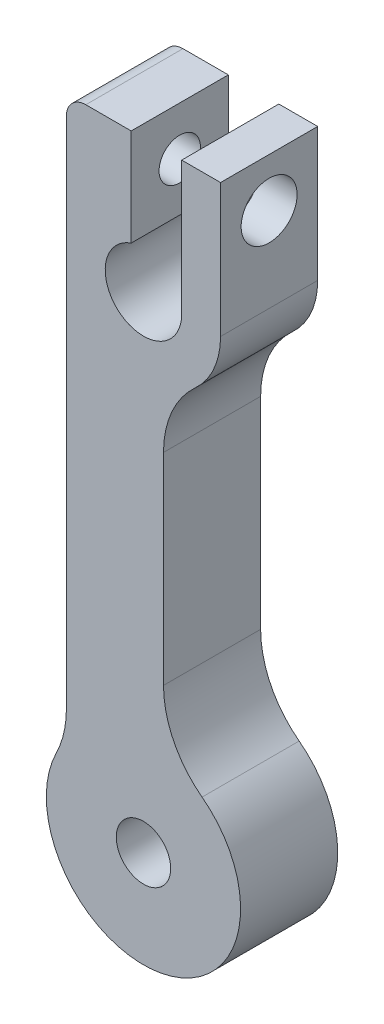
ISO-10303-21;
HEADER;
FILE_DESCRIPTION(('STEP AP214'),'2;1');
FILE_NAME('part.step','',(''),(''),'','','');
FILE_SCHEMA(('AUTOMOTIVE_DESIGN { 1 0 10303 214 1 1 1 1 }'));
ENDSEC;
DATA;
#1=APPLICATION_CONTEXT('core data for automotive mechanical design processes');
#2=APPLICATION_PROTOCOL_DEFINITION('international standard','automotive_design',2000,#1);
#3=PRODUCT_CONTEXT('',#1,'mechanical');
#4=PRODUCT('Part','Part','',(#3));
#5=PRODUCT_RELATED_PRODUCT_CATEGORY('part','',(#4));
#6=PRODUCT_DEFINITION_FORMATION('','',#4);
#7=PRODUCT_DEFINITION_CONTEXT('part definition',#1,'design');
#8=PRODUCT_DEFINITION('design','',#6,#7);
#9=PRODUCT_DEFINITION_SHAPE('','',#8);
#10=(LENGTH_UNIT() NAMED_UNIT(*) SI_UNIT(.MILLI.,.METRE.));
#11=(NAMED_UNIT(*) PLANE_ANGLE_UNIT() SI_UNIT($,.RADIAN.));
#12=(NAMED_UNIT(*) SI_UNIT($,.STERADIAN.) SOLID_ANGLE_UNIT());
#13=UNCERTAINTY_MEASURE_WITH_UNIT(LENGTH_MEASURE(1.E-05),#10,'distance_accuracy_value','');
#14=(GEOMETRIC_REPRESENTATION_CONTEXT(3) GLOBAL_UNCERTAINTY_ASSIGNED_CONTEXT((#13)) GLOBAL_UNIT_ASSIGNED_CONTEXT((#10,
#11,#12)) REPRESENTATION_CONTEXT('',''));
#15=CARTESIAN_POINT('',(0.,0.,0.));
#16=DIRECTION('',(0.,0.,1.));
#17=DIRECTION('',(1.,0.,0.));
#18=AXIS2_PLACEMENT_3D('',#15,#16,#17);
#19=CARTESIAN_POINT('',(7.66,10.1298766033945,6.35));
#20=DIRECTION('',(0.,0.,1.));
#21=DIRECTION('',(1.,0.,0.));
#22=AXIS2_PLACEMENT_3D('',#19,#20,#21);
#23=PLANE('',#22);
#24=DIRECTION('',(-1.,0.,0.));
#25=VECTOR('',#24,1.);
#26=CARTESIAN_POINT('',(-0.802,40.4678673949358,6.35));
#27=LINE('',#26,#25);
#28=CARTESIAN_POINT('',(-0.802,40.4678673949358,6.35));
#29=VERTEX_POINT('',#28);
#30=CARTESIAN_POINT('',(-3.77,40.4678673949358,6.35));
#31=VERTEX_POINT('',#30);
#32=EDGE_CURVE('E241',#29,#31,#27,.T.);
#33=ORIENTED_EDGE('',*,*,#32,.T.);
#34=CARTESIAN_POINT('',(-3.77,39.1978673949358,6.35));
#35=DIRECTION('',(0.,0.,1.));
#36=DIRECTION('',(1.,0.,0.));
#37=AXIS2_PLACEMENT_3D('',#34,#35,#36);
#38=CIRCLE('',#37,1.27);
#39=CARTESIAN_POINT('',(-5.04,39.1978673949358,6.35));
#40=VERTEX_POINT('',#39);
#41=EDGE_CURVE('E13',#31,#40,#38,.T.);
#42=ORIENTED_EDGE('',*,*,#41,.T.);
#43=DIRECTION('',(0.,-1.,0.));
#44=VECTOR('',#43,1.);
#45=CARTESIAN_POINT('',(-5.04,40.4678673949358,6.35));
#46=LINE('',#45,#44);
#47=CARTESIAN_POINT('',(-5.04,5.61764185401669,6.35));
#48=VERTEX_POINT('',#47);
#49=EDGE_CURVE('E239',#40,#48,#46,.T.);
#50=ORIENTED_EDGE('',*,*,#49,.T.);
#51=CARTESIAN_POINT('',(-11.39,5.61764185401669,6.35));
#52=DIRECTION('',(0.,0.,-1.));
#53=DIRECTION('',(-1.,0.,0.));
#54=AXIS2_PLACEMENT_3D('',#51,#52,#53);
#55=CIRCLE('',#54,6.35);
#56=CARTESIAN_POINT('',(-5.695,2.80882092700834,6.35));
#57=VERTEX_POINT('',#56);
#58=EDGE_CURVE('E237',#48,#57,#55,.T.);
#59=ORIENTED_EDGE('',*,*,#58,.T.);
#60=CARTESIAN_POINT('',(0.,0.,6.35));
#61=DIRECTION('',(0.,0.,1.));
#62=DIRECTION('',(1.,0.,0.));
#63=AXIS2_PLACEMENT_3D('',#60,#61,#62);
#64=CIRCLE('',#63,6.35);
#65=CARTESIAN_POINT('',(3.83,5.06493830169727,6.35));
#66=VERTEX_POINT('',#65);
#67=EDGE_CURVE('E166',#57,#66,#64,.T.);
#68=ORIENTED_EDGE('',*,*,#67,.T.);
#69=CARTESIAN_POINT('',(7.66,10.1298766033945,6.35));
#70=DIRECTION('',(0.,0.,-1.));
#71=DIRECTION('',(1.,0.,0.));
#72=AXIS2_PLACEMENT_3D('',#69,#70,#71);
#73=CIRCLE('',#72,6.35);
#74=CARTESIAN_POINT('',(1.31,10.1298766033945,6.35));
#75=VERTEX_POINT('',#74);
#76=EDGE_CURVE('E161',#66,#75,#73,.T.);
#77=ORIENTED_EDGE('',*,*,#76,.T.);
#78=DIRECTION('',(0.,1.,0.));
#79=VECTOR('',#78,1.);
#80=CARTESIAN_POINT('',(1.31,10.1298766033945,6.35));
#81=LINE('',#80,#79);
#82=CARTESIAN_POINT('',(1.31,23.3204982353641,6.35));
#83=VERTEX_POINT('',#82);
#84=EDGE_CURVE('E150',#75,#83,#81,.T.);
#85=ORIENTED_EDGE('',*,*,#84,.T.);
#86=CARTESIAN_POINT('',(7.66,23.3204982353641,6.35));
#87=DIRECTION('',(0.,0.,-1.));
#88=DIRECTION('',(-1.,0.,0.));
#89=AXIS2_PLACEMENT_3D('',#86,#87,#88);
#90=CIRCLE('',#89,6.35);
#91=CARTESIAN_POINT('',(3.38949956101844,28.0200009750865,6.35));
#92=VERTEX_POINT('',#91);
#93=EDGE_CURVE('E160',#83,#92,#90,.T.);
#94=ORIENTED_EDGE('',*,*,#93,.T.);
#95=CARTESIAN_POINT('',(0.,31.75,6.35));
#96=DIRECTION('',(0.,0.,1.));
#97=DIRECTION('',(-1.,0.,0.));
#98=AXIS2_PLACEMENT_3D('',#95,#96,#97);
#99=CIRCLE('',#98,5.04);
#100=CARTESIAN_POINT('',(5.04,31.75,6.35));
#101=VERTEX_POINT('',#100);
#102=EDGE_CURVE('E253',#92,#101,#99,.T.);
#103=ORIENTED_EDGE('',*,*,#102,.T.);
#104=DIRECTION('',(0.,1.,0.));
#105=VECTOR('',#104,1.);
#106=CARTESIAN_POINT('',(5.04,31.75,6.35));
#107=LINE('',#106,#105);
#108=CARTESIAN_POINT('',(5.04,40.4678673949358,6.35));
#109=VERTEX_POINT('',#108);
#110=EDGE_CURVE('E251',#101,#109,#107,.T.);
#111=ORIENTED_EDGE('',*,*,#110,.T.);
#112=DIRECTION('',(-1.,0.,0.));
#113=VECTOR('',#112,1.);
#114=CARTESIAN_POINT('',(2.5,40.4678673949358,6.35));
#115=LINE('',#114,#113);
#116=CARTESIAN_POINT('',(2.5,40.4678673949358,6.35));
#117=VERTEX_POINT('',#116);
#118=EDGE_CURVE('E249',#109,#117,#115,.T.);
#119=ORIENTED_EDGE('',*,*,#118,.T.);
#120=DIRECTION('',(0.,-1.,0.));
#121=VECTOR('',#120,1.);
#122=CARTESIAN_POINT('',(2.5,31.75,6.35));
#123=LINE('',#122,#121);
#124=CARTESIAN_POINT('',(2.5,31.75,6.35));
#125=VERTEX_POINT('',#124);
#126=EDGE_CURVE('E247',#117,#125,#123,.T.);
#127=ORIENTED_EDGE('',*,*,#126,.T.);
#128=CARTESIAN_POINT('',(0.,31.75,6.35));
#129=DIRECTION('',(0.,0.,-1.));
#130=DIRECTION('',(1.,0.,0.));
#131=AXIS2_PLACEMENT_3D('',#128,#129,#130);
#132=CIRCLE('',#131,2.5);
#133=CARTESIAN_POINT('',(-0.802,34.1178673949358,6.35));
#134=VERTEX_POINT('',#133);
#135=EDGE_CURVE('E245',#125,#134,#132,.T.);
#136=ORIENTED_EDGE('',*,*,#135,.T.);
#137=DIRECTION('',(0.,1.,0.));
#138=VECTOR('',#137,1.);
#139=CARTESIAN_POINT('',(-0.802,34.1178673949358,6.35));
#140=LINE('',#139,#138);
#141=EDGE_CURVE('E243',#134,#29,#140,.T.);
#142=ORIENTED_EDGE('',*,*,#141,.T.);
#143=EDGE_LOOP('',(#33,#42,#50,#59,#68,#77,#85,#94,#103,#111,#119,#127,#136,#142));
#144=FACE_BOUND('',#143,.T.);
#145=CARTESIAN_POINT('',(0.,0.,6.35));
#146=DIRECTION('',(0.,0.,1.));
#147=DIRECTION('',(1.,0.,0.));
#148=AXIS2_PLACEMENT_3D('',#145,#146,#147);
#149=CIRCLE('',#148,1.778);
#150=CARTESIAN_POINT('',(1.778,0.,6.35));
#151=VERTEX_POINT('',#150);
#152=EDGE_CURVE('E235',#151,#151,#149,.T.);
#153=ORIENTED_EDGE('',*,*,#152,.F.);
#154=EDGE_LOOP('',(#153));
#155=FACE_BOUND('',#154,.T.);
#156=ADVANCED_FACE('F49',(#144,#155),#23,.T.);
#157=CARTESIAN_POINT('',(7.66,10.1298766033945,0.));
#158=DIRECTION('',(0.,0.,1.));
#159=DIRECTION('',(1.,0.,0.));
#160=AXIS2_PLACEMENT_3D('',#157,#158,#159);
#161=PLANE('',#160);
#162=DIRECTION('',(0.,-1.,0.));
#163=VECTOR('',#162,1.);
#164=CARTESIAN_POINT('',(-5.04,31.75,0.));
#165=LINE('',#164,#163);
#166=CARTESIAN_POINT('',(-5.04,39.1978673949358,0.));
#167=VERTEX_POINT('',#166);
#168=CARTESIAN_POINT('',(-5.04,5.61764185401669,0.));
#169=VERTEX_POINT('',#168);
#170=EDGE_CURVE('E214',#167,#169,#165,.T.);
#171=ORIENTED_EDGE('',*,*,#170,.F.);
#172=CARTESIAN_POINT('',(-3.77,39.1978673949358,0.));
#173=DIRECTION('',(0.,0.,1.));
#174=DIRECTION('',(1.,0.,0.));
#175=AXIS2_PLACEMENT_3D('',#172,#173,#174);
#176=CIRCLE('',#175,1.27);
#177=CARTESIAN_POINT('',(-3.77,40.4678673949358,0.));
#178=VERTEX_POINT('',#177);
#179=EDGE_CURVE('E71',#167,#178,#176,.F.);
#180=ORIENTED_EDGE('',*,*,#179,.T.);
#181=DIRECTION('',(-1.,0.,0.));
#182=VECTOR('',#181,1.);
#183=CARTESIAN_POINT('',(-0.802,40.4678673949358,0.));
#184=LINE('',#183,#182);
#185=CARTESIAN_POINT('',(-0.802,40.4678673949358,0.));
#186=VERTEX_POINT('',#185);
#187=EDGE_CURVE('E216',#186,#178,#184,.T.);
#188=ORIENTED_EDGE('',*,*,#187,.F.);
#189=DIRECTION('',(0.,1.,0.));
#190=VECTOR('',#189,1.);
#191=CARTESIAN_POINT('',(-0.802,34.1178673949358,0.));
#192=LINE('',#191,#190);
#193=CARTESIAN_POINT('',(-0.802,34.1178673949358,0.));
#194=VERTEX_POINT('',#193);
#195=EDGE_CURVE('E218',#194,#186,#192,.T.);
#196=ORIENTED_EDGE('',*,*,#195,.F.);
#197=CARTESIAN_POINT('',(0.,31.75,0.));
#198=DIRECTION('',(0.,0.,-1.));
#199=DIRECTION('',(1.,0.,0.));
#200=AXIS2_PLACEMENT_3D('',#197,#198,#199);
#201=CIRCLE('',#200,2.5);
#202=CARTESIAN_POINT('',(2.5,31.75,0.));
#203=VERTEX_POINT('',#202);
#204=EDGE_CURVE('E220',#203,#194,#201,.T.);
#205=ORIENTED_EDGE('',*,*,#204,.F.);
#206=DIRECTION('',(0.,-1.,0.));
#207=VECTOR('',#206,1.);
#208=CARTESIAN_POINT('',(2.5,31.75,0.));
#209=LINE('',#208,#207);
#210=CARTESIAN_POINT('',(2.5,40.4678673949358,0.));
#211=VERTEX_POINT('',#210);
#212=EDGE_CURVE('E222',#211,#203,#209,.T.);
#213=ORIENTED_EDGE('',*,*,#212,.F.);
#214=DIRECTION('',(-1.,0.,0.));
#215=VECTOR('',#214,1.);
#216=CARTESIAN_POINT('',(2.5,40.4678673949358,0.));
#217=LINE('',#216,#215);
#218=CARTESIAN_POINT('',(5.04,40.4678673949358,0.));
#219=VERTEX_POINT('',#218);
#220=EDGE_CURVE('E224',#219,#211,#217,.T.);
#221=ORIENTED_EDGE('',*,*,#220,.F.);
#222=DIRECTION('',(0.,1.,0.));
#223=VECTOR('',#222,1.);
#224=CARTESIAN_POINT('',(5.04,31.75,0.));
#225=LINE('',#224,#223);
#226=CARTESIAN_POINT('',(5.04,31.75,0.));
#227=VERTEX_POINT('',#226);
#228=EDGE_CURVE('E226',#227,#219,#225,.T.);
#229=ORIENTED_EDGE('',*,*,#228,.F.);
#230=CARTESIAN_POINT('',(0.,31.75,0.));
#231=DIRECTION('',(0.,0.,1.));
#232=DIRECTION('',(-1.,0.,0.));
#233=AXIS2_PLACEMENT_3D('',#230,#231,#232);
#234=CIRCLE('',#233,5.04);
#235=CARTESIAN_POINT('',(3.38949956101844,28.0200009750865,0.));
#236=VERTEX_POINT('',#235);
#237=EDGE_CURVE('E228',#236,#227,#234,.T.);
#238=ORIENTED_EDGE('',*,*,#237,.F.);
#239=CARTESIAN_POINT('',(7.66,23.3204982353641,0.));
#240=DIRECTION('',(0.,0.,-1.));
#241=DIRECTION('',(-1.,0.,0.));
#242=AXIS2_PLACEMENT_3D('',#239,#240,#241);
#243=CIRCLE('',#242,6.35);
#244=CARTESIAN_POINT('',(1.31,23.3204982353641,0.));
#245=VERTEX_POINT('',#244);
#246=EDGE_CURVE('E230',#245,#236,#243,.T.);
#247=ORIENTED_EDGE('',*,*,#246,.F.);
#248=DIRECTION('',(0.,1.,0.));
#249=VECTOR('',#248,1.);
#250=CARTESIAN_POINT('',(1.31,10.1298766033945,0.));
#251=LINE('',#250,#249);
#252=CARTESIAN_POINT('',(1.31,10.1298766033945,0.));
#253=VERTEX_POINT('',#252);
#254=EDGE_CURVE('E232',#253,#245,#251,.T.);
#255=ORIENTED_EDGE('',*,*,#254,.F.);
#256=CARTESIAN_POINT('',(7.66,10.1298766033945,0.));
#257=DIRECTION('',(0.,0.,-1.));
#258=DIRECTION('',(1.,0.,0.));
#259=AXIS2_PLACEMENT_3D('',#256,#257,#258);
#260=CIRCLE('',#259,6.35);
#261=CARTESIAN_POINT('',(3.83,5.06493830169727,0.));
#262=VERTEX_POINT('',#261);
#263=EDGE_CURVE('E174',#262,#253,#260,.T.);
#264=ORIENTED_EDGE('',*,*,#263,.F.);
#265=CARTESIAN_POINT('',(0.,0.,0.));
#266=DIRECTION('',(0.,0.,1.));
#267=DIRECTION('',(1.,0.,0.));
#268=AXIS2_PLACEMENT_3D('',#265,#266,#267);
#269=CIRCLE('',#268,6.35);
#270=CARTESIAN_POINT('',(-5.695,2.80882092700834,0.));
#271=VERTEX_POINT('',#270);
#272=EDGE_CURVE('E170',#271,#262,#269,.T.);
#273=ORIENTED_EDGE('',*,*,#272,.F.);
#274=CARTESIAN_POINT('',(-11.39,5.61764185401669,0.));
#275=DIRECTION('',(0.,0.,-1.));
#276=DIRECTION('',(-1.,0.,0.));
#277=AXIS2_PLACEMENT_3D('',#274,#275,#276);
#278=CIRCLE('',#277,6.35);
#279=EDGE_CURVE('E212',#169,#271,#278,.T.);
#280=ORIENTED_EDGE('',*,*,#279,.F.);
#281=EDGE_LOOP('',(#171,#180,#188,#196,#205,#213,#221,#229,#238,#247,#255,#264,#273,#280));
#282=FACE_BOUND('',#281,.T.);
#283=CARTESIAN_POINT('',(0.,0.,0.));
#284=DIRECTION('',(0.,0.,1.));
#285=DIRECTION('',(1.,0.,0.));
#286=AXIS2_PLACEMENT_3D('',#283,#284,#285);
#287=CIRCLE('',#286,1.778);
#288=CARTESIAN_POINT('',(1.778,0.,0.));
#289=VERTEX_POINT('',#288);
#290=EDGE_CURVE('E256',#289,#289,#287,.T.);
#291=ORIENTED_EDGE('',*,*,#290,.T.);
#292=EDGE_LOOP('',(#291));
#293=FACE_BOUND('',#292,.T.);
#294=ADVANCED_FACE('F293',(#282,#293),#161,.F.);
#295=CARTESIAN_POINT('',(7.66,10.1298766033945,6.35));
#296=DIRECTION('',(0.,0.,-1.));
#297=DIRECTION('',(-1.,0.,0.));
#298=AXIS2_PLACEMENT_3D('',#295,#296,#297);
#299=CYLINDRICAL_SURFACE('',#298,6.35);
#300=ORIENTED_EDGE('',*,*,#263,.T.);
#301=DIRECTION('',(0.,0.,-1.));
#302=VECTOR('',#301,1.);
#303=CARTESIAN_POINT('',(1.31,10.1298766033945,6.35));
#304=LINE('',#303,#302);
#305=EDGE_CURVE('E154',#75,#253,#304,.T.);
#306=ORIENTED_EDGE('',*,*,#305,.F.);
#307=ORIENTED_EDGE('',*,*,#76,.F.);
#308=DIRECTION('',(0.,0.,-1.));
#309=VECTOR('',#308,1.);
#310=CARTESIAN_POINT('',(3.83,5.06493830169727,6.35));
#311=LINE('',#310,#309);
#312=EDGE_CURVE('E209',#66,#262,#311,.T.);
#313=ORIENTED_EDGE('',*,*,#312,.T.);
#314=EDGE_LOOP('',(#300,#306,#307,#313));
#315=FACE_BOUND('',#314,.T.);
#316=ADVANCED_FACE('F172',(#315),#299,.F.);
#317=CARTESIAN_POINT('',(1.31,10.1298766033945,6.35));
#318=DIRECTION('',(-1.,0.,0.));
#319=DIRECTION('',(0.,0.,1.));
#320=AXIS2_PLACEMENT_3D('',#317,#318,#319);
#321=PLANE('',#320);
#322=ORIENTED_EDGE('',*,*,#254,.T.);
#323=DIRECTION('',(0.,0.,-1.));
#324=VECTOR('',#323,1.);
#325=CARTESIAN_POINT('',(1.31,23.3204982353641,6.35));
#326=LINE('',#325,#324);
#327=EDGE_CURVE('E157',#83,#245,#326,.T.);
#328=ORIENTED_EDGE('',*,*,#327,.F.);
#329=ORIENTED_EDGE('',*,*,#84,.F.);
#330=ORIENTED_EDGE('',*,*,#305,.T.);
#331=EDGE_LOOP('',(#322,#328,#329,#330));
#332=FACE_BOUND('',#331,.T.);
#333=ADVANCED_FACE('F152',(#332),#321,.F.);
#334=CARTESIAN_POINT('',(7.66,23.3204982353641,6.35));
#335=DIRECTION('',(0.,0.,-1.));
#336=DIRECTION('',(-1.,0.,0.));
#337=AXIS2_PLACEMENT_3D('',#334,#335,#336);
#338=CYLINDRICAL_SURFACE('',#337,6.35);
#339=ORIENTED_EDGE('',*,*,#246,.T.);
#340=DIRECTION('',(0.,0.,-1.));
#341=VECTOR('',#340,1.);
#342=CARTESIAN_POINT('',(3.38949956101844,28.0200009750865,6.35));
#343=LINE('',#342,#341);
#344=EDGE_CURVE('E179',#92,#236,#343,.T.);
#345=ORIENTED_EDGE('',*,*,#344,.F.);
#346=ORIENTED_EDGE('',*,*,#93,.F.);
#347=ORIENTED_EDGE('',*,*,#327,.T.);
#348=EDGE_LOOP('',(#339,#345,#346,#347));
#349=FACE_BOUND('',#348,.T.);
#350=ADVANCED_FACE('F312',(#349),#338,.F.);
#351=CARTESIAN_POINT('',(0.,31.75,6.35));
#352=DIRECTION('',(0.,0.,-1.));
#353=DIRECTION('',(-1.,0.,0.));
#354=AXIS2_PLACEMENT_3D('',#351,#352,#353);
#355=CYLINDRICAL_SURFACE('',#354,5.04);
#356=ORIENTED_EDGE('',*,*,#237,.T.);
#357=DIRECTION('',(0.,0.,-1.));
#358=VECTOR('',#357,1.);
#359=CARTESIAN_POINT('',(5.04,31.75,6.35));
#360=LINE('',#359,#358);
#361=EDGE_CURVE('E185',#101,#227,#360,.T.);
#362=ORIENTED_EDGE('',*,*,#361,.F.);
#363=ORIENTED_EDGE('',*,*,#102,.F.);
#364=ORIENTED_EDGE('',*,*,#344,.T.);
#365=EDGE_LOOP('',(#356,#362,#363,#364));
#366=FACE_BOUND('',#365,.T.);
#367=ADVANCED_FACE('F281',(#366),#355,.T.);
#368=CARTESIAN_POINT('',(5.04,31.75,6.35));
#369=DIRECTION('',(-1.,0.,0.));
#370=DIRECTION('',(0.,-1.,0.));
#371=AXIS2_PLACEMENT_3D('',#368,#369,#370);
#372=PLANE('',#371);
#373=CARTESIAN_POINT('',(5.04,37.2928673949358,3.175));
#374=DIRECTION('',(1.,0.,0.));
#375=DIRECTION('',(0.,0.,-1.));
#376=AXIS2_PLACEMENT_3D('',#373,#374,#375);
#377=CIRCLE('',#376,1.82879999999999);
#378=CARTESIAN_POINT('',(5.04,37.2928673949358,1.34620000000001));
#379=VERTEX_POINT('',#378);
#380=EDGE_CURVE('E270',#379,#379,#377,.T.);
#381=ORIENTED_EDGE('',*,*,#380,.F.);
#382=EDGE_LOOP('',(#381));
#383=FACE_BOUND('',#382,.T.);
#384=ORIENTED_EDGE('',*,*,#228,.T.);
#385=DIRECTION('',(0.,0.,-1.));
#386=VECTOR('',#385,1.);
#387=CARTESIAN_POINT('',(5.04,40.4678673949358,6.35));
#388=LINE('',#387,#386);
#389=EDGE_CURVE('E188',#109,#219,#388,.T.);
#390=ORIENTED_EDGE('',*,*,#389,.F.);
#391=ORIENTED_EDGE('',*,*,#110,.F.);
#392=ORIENTED_EDGE('',*,*,#361,.T.);
#393=EDGE_LOOP('',(#384,#390,#391,#392));
#394=FACE_BOUND('',#393,.T.);
#395=ADVANCED_FACE('F277',(#383,#394),#372,.F.);
#396=CARTESIAN_POINT('',(2.5,40.4678673949358,6.35));
#397=DIRECTION('',(0.,-1.,0.));
#398=DIRECTION('',(0.,0.,-1.));
#399=AXIS2_PLACEMENT_3D('',#396,#397,#398);
#400=PLANE('',#399);
#401=ORIENTED_EDGE('',*,*,#220,.T.);
#402=DIRECTION('',(0.,0.,-1.));
#403=VECTOR('',#402,1.);
#404=CARTESIAN_POINT('',(2.5,40.4678673949358,6.35));
#405=LINE('',#404,#403);
#406=EDGE_CURVE('E191',#117,#211,#405,.T.);
#407=ORIENTED_EDGE('',*,*,#406,.F.);
#408=ORIENTED_EDGE('',*,*,#118,.F.);
#409=ORIENTED_EDGE('',*,*,#389,.T.);
#410=EDGE_LOOP('',(#401,#407,#408,#409));
#411=FACE_BOUND('',#410,.T.);
#412=ADVANCED_FACE('F280',(#411),#400,.F.);
#413=CARTESIAN_POINT('',(2.5,31.75,6.35));
#414=DIRECTION('',(1.,0.,0.));
#415=DIRECTION('',(0.,1.,0.));
#416=AXIS2_PLACEMENT_3D('',#413,#414,#415);
#417=PLANE('',#416);
#418=CARTESIAN_POINT('',(2.5,37.2928673949358,3.175));
#419=DIRECTION('',(1.,0.,0.));
#420=DIRECTION('',(0.,1.,0.));
#421=AXIS2_PLACEMENT_3D('',#418,#419,#420);
#422=CIRCLE('',#421,1.8288);
#423=CARTESIAN_POINT('',(2.5,39.1216673949358,3.175));
#424=VERTEX_POINT('',#423);
#425=EDGE_CURVE('E267',#424,#424,#422,.T.);
#426=ORIENTED_EDGE('',*,*,#425,.T.);
#427=EDGE_LOOP('',(#426));
#428=FACE_BOUND('',#427,.T.);
#429=ORIENTED_EDGE('',*,*,#212,.T.);
#430=DIRECTION('',(0.,0.,-1.));
#431=VECTOR('',#430,1.);
#432=CARTESIAN_POINT('',(2.5,31.75,6.35));
#433=LINE('',#432,#431);
#434=EDGE_CURVE('E194',#125,#203,#433,.T.);
#435=ORIENTED_EDGE('',*,*,#434,.F.);
#436=ORIENTED_EDGE('',*,*,#126,.F.);
#437=ORIENTED_EDGE('',*,*,#406,.T.);
#438=EDGE_LOOP('',(#429,#435,#436,#437));
#439=FACE_BOUND('',#438,.T.);
#440=ADVANCED_FACE('F299',(#428,#439),#417,.F.);
#441=CARTESIAN_POINT('',(0.,31.75,6.35));
#442=DIRECTION('',(0.,0.,-1.));
#443=DIRECTION('',(-1.,0.,0.));
#444=AXIS2_PLACEMENT_3D('',#441,#442,#443);
#445=CYLINDRICAL_SURFACE('',#444,2.5);
#446=ORIENTED_EDGE('',*,*,#204,.T.);
#447=DIRECTION('',(0.,0.,-1.));
#448=VECTOR('',#447,1.);
#449=CARTESIAN_POINT('',(-0.802,34.1178673949358,6.35));
#450=LINE('',#449,#448);
#451=EDGE_CURVE('E197',#134,#194,#450,.T.);
#452=ORIENTED_EDGE('',*,*,#451,.F.);
#453=ORIENTED_EDGE('',*,*,#135,.F.);
#454=ORIENTED_EDGE('',*,*,#434,.T.);
#455=EDGE_LOOP('',(#446,#452,#453,#454));
#456=FACE_BOUND('',#455,.T.);
#457=ADVANCED_FACE('F303',(#456),#445,.F.);
#458=CARTESIAN_POINT('',(-0.802,34.1178673949358,6.35));
#459=DIRECTION('',(-1.,0.,0.));
#460=DIRECTION('',(0.,0.,1.));
#461=AXIS2_PLACEMENT_3D('',#458,#459,#460);
#462=PLANE('',#461);
#463=CARTESIAN_POINT('',(-0.802,37.2928673949358,3.175));
#464=DIRECTION('',(-1.,0.,0.));
#465=DIRECTION('',(0.,0.,1.));
#466=AXIS2_PLACEMENT_3D('',#463,#464,#465);
#467=CIRCLE('',#466,1.35254999999999);
#468=CARTESIAN_POINT('',(-0.802,37.2928673949358,4.52754999999999));
#469=VERTEX_POINT('',#468);
#470=EDGE_CURVE('E259',#469,#469,#467,.T.);
#471=ORIENTED_EDGE('',*,*,#470,.T.);
#472=EDGE_LOOP('',(#471));
#473=FACE_BOUND('',#472,.T.);
#474=ORIENTED_EDGE('',*,*,#195,.T.);
#475=DIRECTION('',(0.,0.,-1.));
#476=VECTOR('',#475,1.);
#477=CARTESIAN_POINT('',(-0.802,40.4678673949358,6.35));
#478=LINE('',#477,#476);
#479=EDGE_CURVE('E200',#29,#186,#478,.T.);
#480=ORIENTED_EDGE('',*,*,#479,.F.);
#481=ORIENTED_EDGE('',*,*,#141,.F.);
#482=ORIENTED_EDGE('',*,*,#451,.T.);
#483=EDGE_LOOP('',(#474,#480,#481,#482));
#484=FACE_BOUND('',#483,.T.);
#485=ADVANCED_FACE('F346',(#473,#484),#462,.F.);
#486=CARTESIAN_POINT('',(-0.802,40.4678673949358,6.35));
#487=DIRECTION('',(0.,-1.,0.));
#488=DIRECTION('',(0.,0.,-1.));
#489=AXIS2_PLACEMENT_3D('',#486,#487,#488);
#490=PLANE('',#489);
#491=ORIENTED_EDGE('',*,*,#187,.T.);
#492=DIRECTION('',(0.,0.,-1.));
#493=VECTOR('',#492,1.);
#494=CARTESIAN_POINT('',(-3.77,40.4678673949358,6.35));
#495=LINE('',#494,#493);
#496=EDGE_CURVE('E57',#178,#31,#495,.F.);
#497=ORIENTED_EDGE('',*,*,#496,.T.);
#498=ORIENTED_EDGE('',*,*,#32,.F.);
#499=ORIENTED_EDGE('',*,*,#479,.T.);
#500=EDGE_LOOP('',(#491,#497,#498,#499));
#501=FACE_BOUND('',#500,.T.);
#502=ADVANCED_FACE('F342',(#501),#490,.F.);
#503=CARTESIAN_POINT('',(-5.04,31.75,6.35));
#504=DIRECTION('',(1.,0.,0.));
#505=DIRECTION('',(0.,1.,0.));
#506=AXIS2_PLACEMENT_3D('',#503,#504,#505);
#507=PLANE('',#506);
#508=CARTESIAN_POINT('',(-5.04,37.2928673949358,3.175));
#509=DIRECTION('',(-1.,0.,0.));
#510=DIRECTION('',(0.,0.,1.));
#511=AXIS2_PLACEMENT_3D('',#508,#509,#510);
#512=CIRCLE('',#511,1.35254999999999);
#513=CARTESIAN_POINT('',(-5.04,37.2928673949358,4.52754999999999));
#514=VERTEX_POINT('',#513);
#515=EDGE_CURVE('E264',#514,#514,#512,.T.);
#516=ORIENTED_EDGE('',*,*,#515,.F.);
#517=EDGE_LOOP('',(#516));
#518=FACE_BOUND('',#517,.T.);
#519=ORIENTED_EDGE('',*,*,#49,.F.);
#520=DIRECTION('',(0.,0.,-1.));
#521=VECTOR('',#520,1.);
#522=CARTESIAN_POINT('',(-5.04,39.1978673949358,6.35));
#523=LINE('',#522,#521);
#524=EDGE_CURVE('E175',#40,#167,#523,.T.);
#525=ORIENTED_EDGE('',*,*,#524,.T.);
#526=ORIENTED_EDGE('',*,*,#170,.T.);
#527=DIRECTION('',(0.,0.,-1.));
#528=VECTOR('',#527,1.);
#529=CARTESIAN_POINT('',(-5.04,5.61764185401669,6.35));
#530=LINE('',#529,#528);
#531=EDGE_CURVE('E203',#48,#169,#530,.T.);
#532=ORIENTED_EDGE('',*,*,#531,.F.);
#533=EDGE_LOOP('',(#519,#525,#526,#532));
#534=FACE_BOUND('',#533,.T.);
#535=ADVANCED_FACE('F338',(#518,#534),#507,.F.);
#536=CARTESIAN_POINT('',(-11.39,5.61764185401669,6.35));
#537=DIRECTION('',(0.,0.,-1.));
#538=DIRECTION('',(-1.,0.,0.));
#539=AXIS2_PLACEMENT_3D('',#536,#537,#538);
#540=CYLINDRICAL_SURFACE('',#539,6.35);
#541=ORIENTED_EDGE('',*,*,#279,.T.);
#542=DIRECTION('',(0.,0.,-1.));
#543=VECTOR('',#542,1.);
#544=CARTESIAN_POINT('',(-5.695,2.80882092700834,6.35));
#545=LINE('',#544,#543);
#546=EDGE_CURVE('E206',#57,#271,#545,.T.);
#547=ORIENTED_EDGE('',*,*,#546,.F.);
#548=ORIENTED_EDGE('',*,*,#58,.F.);
#549=ORIENTED_EDGE('',*,*,#531,.T.);
#550=EDGE_LOOP('',(#541,#547,#548,#549));
#551=FACE_BOUND('',#550,.T.);
#552=ADVANCED_FACE('F334',(#551),#540,.F.);
#553=CARTESIAN_POINT('',(0.,0.,6.35));
#554=DIRECTION('',(0.,0.,-1.));
#555=DIRECTION('',(-1.,0.,0.));
#556=AXIS2_PLACEMENT_3D('',#553,#554,#555);
#557=CYLINDRICAL_SURFACE('',#556,6.35);
#558=ORIENTED_EDGE('',*,*,#272,.T.);
#559=ORIENTED_EDGE('',*,*,#312,.F.);
#560=ORIENTED_EDGE('',*,*,#67,.F.);
#561=ORIENTED_EDGE('',*,*,#546,.T.);
#562=EDGE_LOOP('',(#558,#559,#560,#561));
#563=FACE_BOUND('',#562,.T.);
#564=ADVANCED_FACE('F331',(#563),#557,.T.);
#565=CARTESIAN_POINT('',(0.,0.,6.35));
#566=DIRECTION('',(0.,0.,-1.));
#567=DIRECTION('',(-1.,0.,0.));
#568=AXIS2_PLACEMENT_3D('',#565,#566,#567);
#569=CYLINDRICAL_SURFACE('',#568,1.778);
#570=ORIENTED_EDGE('',*,*,#152,.T.);
#571=EDGE_LOOP('',(#570));
#572=FACE_BOUND('',#571,.T.);
#573=ORIENTED_EDGE('',*,*,#290,.F.);
#574=EDGE_LOOP('',(#573));
#575=FACE_BOUND('',#574,.T.);
#576=ADVANCED_FACE('F328',(#572,#575),#569,.F.);
#577=CARTESIAN_POINT('',(-3.77,39.1978673949358,6.35));
#578=DIRECTION('',(0.,0.,-1.));
#579=DIRECTION('',(-1.,0.,0.));
#580=AXIS2_PLACEMENT_3D('',#577,#578,#579);
#581=CYLINDRICAL_SURFACE('',#580,1.27);
#582=ORIENTED_EDGE('',*,*,#41,.F.);
#583=ORIENTED_EDGE('',*,*,#496,.F.);
#584=ORIENTED_EDGE('',*,*,#179,.F.);
#585=ORIENTED_EDGE('',*,*,#524,.F.);
#586=EDGE_LOOP('',(#582,#583,#584,#585));
#587=FACE_BOUND('',#586,.T.);
#588=ADVANCED_FACE('F51',(#587),#581,.T.);
#589=CARTESIAN_POINT('',(-5.04,37.2928673949358,3.175));
#590=DIRECTION('',(-1.,0.,0.));
#591=DIRECTION('',(0.,0.,1.));
#592=AXIS2_PLACEMENT_3D('',#589,#590,#591);
#593=CYLINDRICAL_SURFACE('',#592,1.35254999999999);
#594=ORIENTED_EDGE('',*,*,#515,.T.);
#595=EDGE_LOOP('',(#594));
#596=FACE_BOUND('',#595,.T.);
#597=ORIENTED_EDGE('',*,*,#470,.F.);
#598=EDGE_LOOP('',(#597));
#599=FACE_BOUND('',#598,.T.);
#600=ADVANCED_FACE('F404',(#596,#599),#593,.F.);
#601=CARTESIAN_POINT('',(5.04,37.2928673949358,3.175));
#602=DIRECTION('',(1.,0.,0.));
#603=DIRECTION('',(0.,0.,-1.));
#604=AXIS2_PLACEMENT_3D('',#601,#602,#603);
#605=CYLINDRICAL_SURFACE('',#604,1.8288);
#606=ORIENTED_EDGE('',*,*,#380,.T.);
#607=EDGE_LOOP('',(#606));
#608=FACE_BOUND('',#607,.T.);
#609=ORIENTED_EDGE('',*,*,#425,.F.);
#610=EDGE_LOOP('',(#609));
#611=FACE_BOUND('',#610,.T.);
#612=ADVANCED_FACE('F274',(#608,#611),#605,.F.);
#613=CLOSED_SHELL('',(#156,#294,#316,#333,#350,#367,#395,#412,#440,#457,#485,#502,#535,#552,
#564,#576,#588,#600,#612));
#614=MANIFOLD_SOLID_BREP('B2',#613);
#615=ADVANCED_BREP_SHAPE_REPRESENTATION('',(#18,#614),#14);
#616=SHAPE_DEFINITION_REPRESENTATION(#9,#615);
ENDSEC;
END-ISO-10303-21;
